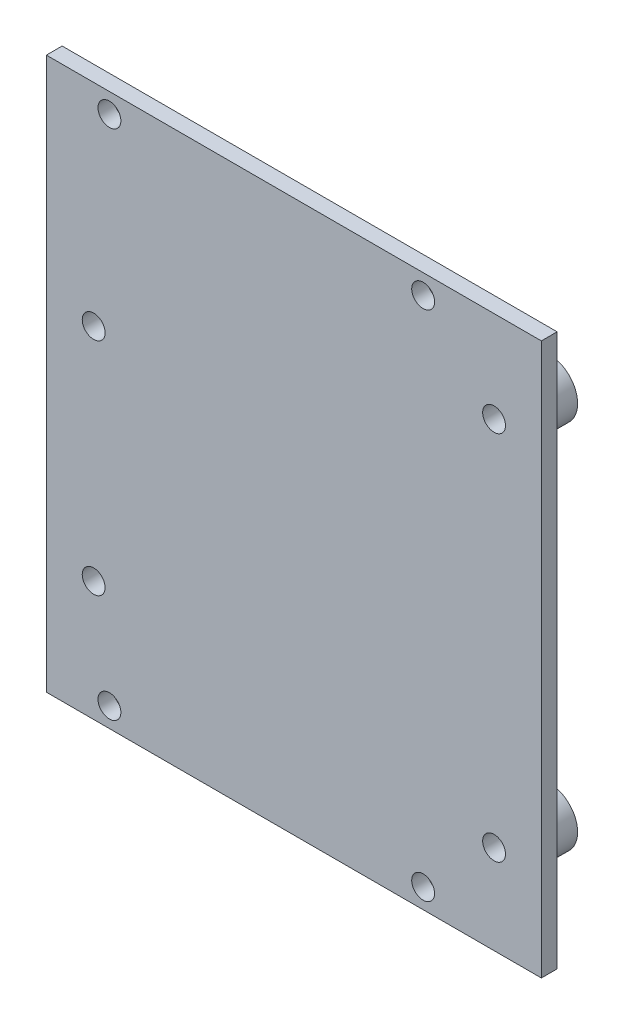
ISO-10303-21;
HEADER;
FILE_DESCRIPTION(('STEP AP214'),'2;1');
FILE_NAME('part.step','',(''),(''),'','','');
FILE_SCHEMA(('AUTOMOTIVE_DESIGN { 1 0 10303 214 1 1 1 1 }'));
ENDSEC;
DATA;
#1=APPLICATION_CONTEXT('core data for automotive mechanical design processes');
#2=APPLICATION_PROTOCOL_DEFINITION('international standard','automotive_design',2000,#1);
#3=PRODUCT_CONTEXT('',#1,'mechanical');
#4=PRODUCT('Part','Part','',(#3));
#5=PRODUCT_RELATED_PRODUCT_CATEGORY('part','',(#4));
#6=PRODUCT_DEFINITION_FORMATION('','',#4);
#7=PRODUCT_DEFINITION_CONTEXT('part definition',#1,'design');
#8=PRODUCT_DEFINITION('design','',#6,#7);
#9=PRODUCT_DEFINITION_SHAPE('','',#8);
#10=(LENGTH_UNIT() NAMED_UNIT(*) SI_UNIT(.MILLI.,.METRE.));
#11=(NAMED_UNIT(*) PLANE_ANGLE_UNIT() SI_UNIT($,.RADIAN.));
#12=(NAMED_UNIT(*) SI_UNIT($,.STERADIAN.) SOLID_ANGLE_UNIT());
#13=UNCERTAINTY_MEASURE_WITH_UNIT(LENGTH_MEASURE(1.E-05),#10,'distance_accuracy_value','');
#14=(GEOMETRIC_REPRESENTATION_CONTEXT(3) GLOBAL_UNCERTAINTY_ASSIGNED_CONTEXT((#13)) GLOBAL_UNIT_ASSIGNED_CONTEXT((#10,
#11,#12)) REPRESENTATION_CONTEXT('',''));
#15=CARTESIAN_POINT('',(0.,0.,0.));
#16=DIRECTION('',(0.,0.,1.));
#17=DIRECTION('',(1.,0.,0.));
#18=AXIS2_PLACEMENT_3D('',#15,#16,#17);
#19=CARTESIAN_POINT('',(-33.,-19.66,5.));
#20=DIRECTION('',(0.,0.,-1.));
#21=DIRECTION('',(-1.,0.,0.));
#22=AXIS2_PLACEMENT_3D('',#19,#20,#21);
#23=CYLINDRICAL_SURFACE('',#22,3.6);
#24=CARTESIAN_POINT('',(-33.,-19.66,5.));
#25=DIRECTION('',(0.,0.,1.));
#26=DIRECTION('',(1.,0.,0.));
#27=AXIS2_PLACEMENT_3D('',#24,#25,#26);
#28=CIRCLE('',#27,3.6);
#29=CARTESIAN_POINT('',(-29.4,-19.66,5.));
#30=VERTEX_POINT('',#29);
#31=EDGE_CURVE('E133',#30,#30,#28,.T.);
#32=ORIENTED_EDGE('',*,*,#31,.F.);
#33=EDGE_LOOP('',(#32));
#34=FACE_BOUND('',#33,.T.);
#35=CARTESIAN_POINT('',(-33.,-19.66,0.));
#36=DIRECTION('',(0.,0.,1.));
#37=DIRECTION('',(1.,0.,0.));
#38=AXIS2_PLACEMENT_3D('',#35,#36,#37);
#39=CIRCLE('',#38,3.6);
#40=CARTESIAN_POINT('',(-29.4,-19.66,0.));
#41=VERTEX_POINT('',#40);
#42=EDGE_CURVE('E132',#41,#41,#39,.T.);
#43=ORIENTED_EDGE('',*,*,#42,.T.);
#44=EDGE_LOOP('',(#43));
#45=FACE_BOUND('',#44,.T.);
#46=ADVANCED_FACE('F41',(#34,#45),#23,.T.);
#47=CARTESIAN_POINT('',(0.,0.,0.));
#48=DIRECTION('',(0.,0.,1.));
#49=DIRECTION('',(1.,0.,0.));
#50=AXIS2_PLACEMENT_3D('',#47,#48,#49);
#51=PLANE('',#50);
#52=CARTESIAN_POINT('',(-33.,-19.66,0.));
#53=DIRECTION('',(0.,0.,-1.));
#54=DIRECTION('',(-1.,0.,0.));
#55=AXIS2_PLACEMENT_3D('',#52,#53,#54);
#56=CIRCLE('',#55,1.44999999999999);
#57=CARTESIAN_POINT('',(-34.45,-19.66,0.));
#58=VERTEX_POINT('',#57);
#59=EDGE_CURVE('E176',#58,#58,#56,.T.);
#60=ORIENTED_EDGE('',*,*,#59,.F.);
#61=EDGE_LOOP('',(#60));
#62=FACE_BOUND('',#61,.T.);
#63=ORIENTED_EDGE('',*,*,#42,.F.);
#64=EDGE_LOOP('',(#63));
#65=FACE_BOUND('',#64,.T.);
#66=ADVANCED_FACE('F242',(#62,#65),#51,.F.);
#67=CARTESIAN_POINT('',(23.8,-34.8699999999999,7.));
#68=DIRECTION('',(-1.,0.,0.));
#69=DIRECTION('',(0.,0.,1.));
#70=AXIS2_PLACEMENT_3D('',#67,#68,#69);
#71=PLANE('',#70);
#72=DIRECTION('',(0.,1.,0.));
#73=VECTOR('',#72,1.);
#74=CARTESIAN_POINT('',(23.8,-34.8699999999999,5.));
#75=LINE('',#74,#73);
#76=CARTESIAN_POINT('',(23.8,-34.8699999999999,5.));
#77=VERTEX_POINT('',#76);
#78=CARTESIAN_POINT('',(23.8,35.1299999999999,5.));
#79=VERTEX_POINT('',#78);
#80=EDGE_CURVE('E115',#77,#79,#75,.T.);
#81=ORIENTED_EDGE('',*,*,#80,.T.);
#82=DIRECTION('',(0.,0.,-1.));
#83=VECTOR('',#82,1.);
#84=CARTESIAN_POINT('',(23.8,35.1299999999999,7.));
#85=LINE('',#84,#83);
#86=CARTESIAN_POINT('',(23.8,35.1299999999999,7.));
#87=VERTEX_POINT('',#86);
#88=EDGE_CURVE('E104',#87,#79,#85,.T.);
#89=ORIENTED_EDGE('',*,*,#88,.F.);
#90=DIRECTION('',(0.,1.,0.));
#91=VECTOR('',#90,1.);
#92=CARTESIAN_POINT('',(23.8,-34.8699999999999,7.));
#93=LINE('',#92,#91);
#94=CARTESIAN_POINT('',(23.8,-34.8699999999999,7.));
#95=VERTEX_POINT('',#94);
#96=EDGE_CURVE('E96',#95,#87,#93,.T.);
#97=ORIENTED_EDGE('',*,*,#96,.F.);
#98=DIRECTION('',(0.,0.,-1.));
#99=VECTOR('',#98,1.);
#100=CARTESIAN_POINT('',(23.8,-34.8699999999999,7.));
#101=LINE('',#100,#99);
#102=EDGE_CURVE('E111',#95,#77,#101,.T.);
#103=ORIENTED_EDGE('',*,*,#102,.T.);
#104=EDGE_LOOP('',(#81,#89,#97,#103));
#105=FACE_BOUND('',#104,.T.);
#106=ADVANCED_FACE('F247',(#105),#71,.F.);
#107=CARTESIAN_POINT('',(23.8,35.1299999999999,7.));
#108=DIRECTION('',(0.,-1.,0.));
#109=DIRECTION('',(1.,0.,0.));
#110=AXIS2_PLACEMENT_3D('',#107,#108,#109);
#111=PLANE('',#110);
#112=DIRECTION('',(-1.,0.,0.));
#113=VECTOR('',#112,1.);
#114=CARTESIAN_POINT('',(23.8,35.1299999999999,5.));
#115=LINE('',#114,#113);
#116=CARTESIAN_POINT('',(-39.,35.1299999999999,5.));
#117=VERTEX_POINT('',#116);
#118=EDGE_CURVE('E102',#79,#117,#115,.T.);
#119=ORIENTED_EDGE('',*,*,#118,.T.);
#120=DIRECTION('',(0.,0.,-1.));
#121=VECTOR('',#120,1.);
#122=CARTESIAN_POINT('',(-39.,35.1299999999999,7.));
#123=LINE('',#122,#121);
#124=CARTESIAN_POINT('',(-39.,35.1299999999999,7.));
#125=VERTEX_POINT('',#124);
#126=EDGE_CURVE('E100',#125,#117,#123,.T.);
#127=ORIENTED_EDGE('',*,*,#126,.F.);
#128=DIRECTION('',(-1.,0.,0.));
#129=VECTOR('',#128,1.);
#130=CARTESIAN_POINT('',(23.8,35.1299999999999,7.));
#131=LINE('',#130,#129);
#132=EDGE_CURVE('E91',#87,#125,#131,.T.);
#133=ORIENTED_EDGE('',*,*,#132,.F.);
#134=ORIENTED_EDGE('',*,*,#88,.T.);
#135=EDGE_LOOP('',(#119,#127,#133,#134));
#136=FACE_BOUND('',#135,.T.);
#137=ADVANCED_FACE('F101',(#136),#111,.F.);
#138=CARTESIAN_POINT('',(-39.,-34.8699999999999,7.));
#139=DIRECTION('',(1.,0.,0.));
#140=DIRECTION('',(0.,0.,-1.));
#141=AXIS2_PLACEMENT_3D('',#138,#139,#140);
#142=PLANE('',#141);
#143=DIRECTION('',(0.,-1.,0.));
#144=VECTOR('',#143,1.);
#145=CARTESIAN_POINT('',(-39.,-34.8699999999999,5.));
#146=LINE('',#145,#144);
#147=CARTESIAN_POINT('',(-39.,-34.8699999999999,5.));
#148=VERTEX_POINT('',#147);
#149=EDGE_CURVE('E77',#117,#148,#146,.T.);
#150=ORIENTED_EDGE('',*,*,#149,.T.);
#151=DIRECTION('',(0.,0.,-1.));
#152=VECTOR('',#151,1.);
#153=CARTESIAN_POINT('',(-39.,-34.8699999999999,7.));
#154=LINE('',#153,#152);
#155=CARTESIAN_POINT('',(-39.,-34.8699999999999,7.));
#156=VERTEX_POINT('',#155);
#157=EDGE_CURVE('E105',#156,#148,#154,.T.);
#158=ORIENTED_EDGE('',*,*,#157,.F.);
#159=DIRECTION('',(0.,-1.,0.));
#160=VECTOR('',#159,1.);
#161=CARTESIAN_POINT('',(-39.,-34.8699999999999,7.));
#162=LINE('',#161,#160);
#163=EDGE_CURVE('E94',#125,#156,#162,.T.);
#164=ORIENTED_EDGE('',*,*,#163,.F.);
#165=ORIENTED_EDGE('',*,*,#126,.T.);
#166=EDGE_LOOP('',(#150,#158,#164,#165));
#167=FACE_BOUND('',#166,.T.);
#168=ADVANCED_FACE('F107',(#167),#142,.F.);
#169=CARTESIAN_POINT('',(23.8,-34.8699999999999,7.));
#170=DIRECTION('',(0.,1.,0.));
#171=DIRECTION('',(-1.,0.,0.));
#172=AXIS2_PLACEMENT_3D('',#169,#170,#171);
#173=PLANE('',#172);
#174=DIRECTION('',(1.,0.,0.));
#175=VECTOR('',#174,1.);
#176=CARTESIAN_POINT('',(23.8,-34.8699999999999,5.));
#177=LINE('',#176,#175);
#178=EDGE_CURVE('E83',#148,#77,#177,.T.);
#179=ORIENTED_EDGE('',*,*,#178,.T.);
#180=ORIENTED_EDGE('',*,*,#102,.F.);
#181=DIRECTION('',(1.,0.,0.));
#182=VECTOR('',#181,1.);
#183=CARTESIAN_POINT('',(23.8,-34.8699999999999,7.));
#184=LINE('',#183,#182);
#185=EDGE_CURVE('E60',#156,#95,#184,.T.);
#186=ORIENTED_EDGE('',*,*,#185,.F.);
#187=ORIENTED_EDGE('',*,*,#157,.T.);
#188=EDGE_LOOP('',(#179,#180,#186,#187));
#189=FACE_BOUND('',#188,.T.);
#190=ADVANCED_FACE('F260',(#189),#173,.F.);
#191=CARTESIAN_POINT('',(0.,0.,7.));
#192=DIRECTION('',(0.,0.,1.));
#193=DIRECTION('',(1.,0.,0.));
#194=AXIS2_PLACEMENT_3D('',#191,#192,#193);
#195=PLANE('',#194);
#196=CARTESIAN_POINT('',(17.8,23.54,7.));
#197=DIRECTION('',(0.,0.,1.));
#198=DIRECTION('',(1.,0.,0.));
#199=AXIS2_PLACEMENT_3D('',#196,#197,#198);
#200=CIRCLE('',#199,1.44999999999999);
#201=CARTESIAN_POINT('',(19.25,23.54,7.));
#202=VERTEX_POINT('',#201);
#203=EDGE_CURVE('E44',#202,#202,#200,.T.);
#204=ORIENTED_EDGE('',*,*,#203,.F.);
#205=EDGE_LOOP('',(#204));
#206=FACE_BOUND('',#205,.T.);
#207=CARTESIAN_POINT('',(-33.,8.33999999999996,7.));
#208=DIRECTION('',(0.,0.,1.));
#209=DIRECTION('',(1.,0.,0.));
#210=AXIS2_PLACEMENT_3D('',#207,#208,#209);
#211=CIRCLE('',#210,1.45);
#212=CARTESIAN_POINT('',(-31.55,8.33999999999996,7.));
#213=VERTEX_POINT('',#212);
#214=EDGE_CURVE('E177',#213,#213,#211,.T.);
#215=ORIENTED_EDGE('',*,*,#214,.F.);
#216=EDGE_LOOP('',(#215));
#217=FACE_BOUND('',#216,.T.);
#218=CARTESIAN_POINT('',(-33.,-19.66,7.));
#219=DIRECTION('',(0.,0.,1.));
#220=DIRECTION('',(1.,0.,0.));
#221=AXIS2_PLACEMENT_3D('',#218,#219,#220);
#222=CIRCLE('',#221,1.44999999999999);
#223=CARTESIAN_POINT('',(-31.55,-19.66,7.));
#224=VERTEX_POINT('',#223);
#225=EDGE_CURVE('E173',#224,#224,#222,.T.);
#226=ORIENTED_EDGE('',*,*,#225,.F.);
#227=EDGE_LOOP('',(#226));
#228=FACE_BOUND('',#227,.T.);
#229=CARTESIAN_POINT('',(17.8,-23.54,7.));
#230=DIRECTION('',(0.,0.,1.));
#231=DIRECTION('',(1.,0.,0.));
#232=AXIS2_PLACEMENT_3D('',#229,#230,#231);
#233=CIRCLE('',#232,1.44999999999999);
#234=CARTESIAN_POINT('',(19.25,-23.54,7.));
#235=VERTEX_POINT('',#234);
#236=EDGE_CURVE('E168',#235,#235,#233,.T.);
#237=ORIENTED_EDGE('',*,*,#236,.F.);
#238=EDGE_LOOP('',(#237));
#239=FACE_BOUND('',#238,.T.);
#240=CARTESIAN_POINT('',(8.80000000000004,-32.37,7.));
#241=DIRECTION('',(0.,0.,1.));
#242=DIRECTION('',(1.,0.,0.));
#243=AXIS2_PLACEMENT_3D('',#240,#241,#242);
#244=CIRCLE('',#243,1.44999999999999);
#245=CARTESIAN_POINT('',(10.25,-32.37,7.));
#246=VERTEX_POINT('',#245);
#247=EDGE_CURVE('E167',#246,#246,#244,.T.);
#248=ORIENTED_EDGE('',*,*,#247,.F.);
#249=EDGE_LOOP('',(#248));
#250=FACE_BOUND('',#249,.T.);
#251=CARTESIAN_POINT('',(-30.9999999999999,-32.3700000000001,7.));
#252=DIRECTION('',(0.,0.,1.));
#253=DIRECTION('',(1.,0.,0.));
#254=AXIS2_PLACEMENT_3D('',#251,#252,#253);
#255=CIRCLE('',#254,1.44999999999999);
#256=CARTESIAN_POINT('',(-29.5499999999999,-32.3700000000001,7.));
#257=VERTEX_POINT('',#256);
#258=EDGE_CURVE('E162',#257,#257,#255,.T.);
#259=ORIENTED_EDGE('',*,*,#258,.F.);
#260=EDGE_LOOP('',(#259));
#261=FACE_BOUND('',#260,.T.);
#262=CARTESIAN_POINT('',(-31.,32.63,7.));
#263=DIRECTION('',(0.,0.,1.));
#264=DIRECTION('',(1.,0.,0.));
#265=AXIS2_PLACEMENT_3D('',#262,#263,#264);
#266=CIRCLE('',#265,1.44999999999999);
#267=CARTESIAN_POINT('',(-29.55,32.63,7.));
#268=VERTEX_POINT('',#267);
#269=EDGE_CURVE('E157',#268,#268,#266,.T.);
#270=ORIENTED_EDGE('',*,*,#269,.F.);
#271=EDGE_LOOP('',(#270));
#272=FACE_BOUND('',#271,.T.);
#273=CARTESIAN_POINT('',(8.79999999999995,32.63,7.));
#274=DIRECTION('',(0.,0.,1.));
#275=DIRECTION('',(1.,0.,0.));
#276=AXIS2_PLACEMENT_3D('',#273,#274,#275);
#277=CIRCLE('',#276,1.44999999999999);
#278=CARTESIAN_POINT('',(10.2499999999999,32.63,7.));
#279=VERTEX_POINT('',#278);
#280=EDGE_CURVE('E152',#279,#279,#277,.T.);
#281=ORIENTED_EDGE('',*,*,#280,.F.);
#282=EDGE_LOOP('',(#281));
#283=FACE_BOUND('',#282,.T.);
#284=ORIENTED_EDGE('',*,*,#96,.T.);
#285=ORIENTED_EDGE('',*,*,#132,.T.);
#286=ORIENTED_EDGE('',*,*,#163,.T.);
#287=ORIENTED_EDGE('',*,*,#185,.T.);
#288=EDGE_LOOP('',(#284,#285,#286,#287));
#289=FACE_BOUND('',#288,.T.);
#290=ADVANCED_FACE('F92',(#206,#217,#228,#239,#250,#261,#272,#283,#289),#195,.T.);
#291=CARTESIAN_POINT('',(0.,0.,5.));
#292=DIRECTION('',(0.,0.,1.));
#293=DIRECTION('',(1.,0.,0.));
#294=AXIS2_PLACEMENT_3D('',#291,#292,#293);
#295=PLANE('',#294);
#296=CARTESIAN_POINT('',(8.80000000000004,-32.37,5.));
#297=DIRECTION('',(0.,0.,1.));
#298=DIRECTION('',(1.,0.,0.));
#299=AXIS2_PLACEMENT_3D('',#296,#297,#298);
#300=CIRCLE('',#299,1.44999999999999);
#301=CARTESIAN_POINT('',(10.25,-32.37,5.));
#302=VERTEX_POINT('',#301);
#303=EDGE_CURVE('E163',#302,#302,#300,.T.);
#304=ORIENTED_EDGE('',*,*,#303,.T.);
#305=EDGE_LOOP('',(#304));
#306=FACE_BOUND('',#305,.T.);
#307=CARTESIAN_POINT('',(-30.9999999999999,-32.3700000000001,5.));
#308=DIRECTION('',(0.,0.,1.));
#309=DIRECTION('',(1.,0.,0.));
#310=AXIS2_PLACEMENT_3D('',#307,#308,#309);
#311=CIRCLE('',#310,1.44999999999999);
#312=CARTESIAN_POINT('',(-29.5499999999999,-32.3700000000001,5.));
#313=VERTEX_POINT('',#312);
#314=EDGE_CURVE('E158',#313,#313,#311,.T.);
#315=ORIENTED_EDGE('',*,*,#314,.T.);
#316=EDGE_LOOP('',(#315));
#317=FACE_BOUND('',#316,.T.);
#318=CARTESIAN_POINT('',(-31.,32.63,5.));
#319=DIRECTION('',(0.,0.,1.));
#320=DIRECTION('',(1.,0.,0.));
#321=AXIS2_PLACEMENT_3D('',#318,#319,#320);
#322=CIRCLE('',#321,1.44999999999999);
#323=CARTESIAN_POINT('',(-29.55,32.63,5.));
#324=VERTEX_POINT('',#323);
#325=EDGE_CURVE('E153',#324,#324,#322,.T.);
#326=ORIENTED_EDGE('',*,*,#325,.T.);
#327=EDGE_LOOP('',(#326));
#328=FACE_BOUND('',#327,.T.);
#329=CARTESIAN_POINT('',(8.79999999999995,32.63,5.));
#330=DIRECTION('',(0.,0.,1.));
#331=DIRECTION('',(1.,0.,0.));
#332=AXIS2_PLACEMENT_3D('',#329,#330,#331);
#333=CIRCLE('',#332,1.44999999999999);
#334=CARTESIAN_POINT('',(10.2499999999999,32.63,5.));
#335=VERTEX_POINT('',#334);
#336=EDGE_CURVE('E147',#335,#335,#333,.T.);
#337=ORIENTED_EDGE('',*,*,#336,.T.);
#338=EDGE_LOOP('',(#337));
#339=FACE_BOUND('',#338,.T.);
#340=CARTESIAN_POINT('',(17.8,23.54,5.));
#341=DIRECTION('',(0.,0.,1.));
#342=DIRECTION('',(1.,0.,0.));
#343=AXIS2_PLACEMENT_3D('',#340,#341,#342);
#344=CIRCLE('',#343,3.6);
#345=CARTESIAN_POINT('',(21.4,23.54,5.));
#346=VERTEX_POINT('',#345);
#347=EDGE_CURVE('E11',#346,#346,#344,.F.);
#348=ORIENTED_EDGE('',*,*,#347,.F.);
#349=EDGE_LOOP('',(#348));
#350=FACE_BOUND('',#349,.T.);
#351=CARTESIAN_POINT('',(17.8,-23.54,5.));
#352=DIRECTION('',(0.,0.,1.));
#353=DIRECTION('',(1.,0.,0.));
#354=AXIS2_PLACEMENT_3D('',#351,#352,#353);
#355=CIRCLE('',#354,3.6);
#356=CARTESIAN_POINT('',(21.4,-23.54,5.));
#357=VERTEX_POINT('',#356);
#358=EDGE_CURVE('E51',#357,#357,#355,.F.);
#359=ORIENTED_EDGE('',*,*,#358,.F.);
#360=EDGE_LOOP('',(#359));
#361=FACE_BOUND('',#360,.T.);
#362=CARTESIAN_POINT('',(-33.,8.33999999999996,5.));
#363=DIRECTION('',(0.,0.,1.));
#364=DIRECTION('',(1.,0.,0.));
#365=AXIS2_PLACEMENT_3D('',#362,#363,#364);
#366=CIRCLE('',#365,3.6);
#367=CARTESIAN_POINT('',(-29.4,8.33999999999996,5.));
#368=VERTEX_POINT('',#367);
#369=EDGE_CURVE('E137',#368,#368,#366,.F.);
#370=ORIENTED_EDGE('',*,*,#369,.F.);
#371=EDGE_LOOP('',(#370));
#372=FACE_BOUND('',#371,.T.);
#373=ORIENTED_EDGE('',*,*,#31,.T.);
#374=EDGE_LOOP('',(#373));
#375=FACE_BOUND('',#374,.T.);
#376=ORIENTED_EDGE('',*,*,#80,.F.);
#377=ORIENTED_EDGE('',*,*,#178,.F.);
#378=ORIENTED_EDGE('',*,*,#149,.F.);
#379=ORIENTED_EDGE('',*,*,#118,.F.);
#380=EDGE_LOOP('',(#376,#377,#378,#379));
#381=FACE_BOUND('',#380,.T.);
#382=ADVANCED_FACE('F237',(#306,#317,#328,#339,#350,#361,#372,#375,#381),#295,.F.);
#383=CARTESIAN_POINT('',(-33.,8.33999999999996,5.));
#384=DIRECTION('',(0.,0.,-1.));
#385=DIRECTION('',(-1.,0.,0.));
#386=AXIS2_PLACEMENT_3D('',#383,#384,#385);
#387=CYLINDRICAL_SURFACE('',#386,3.6);
#388=ORIENTED_EDGE('',*,*,#369,.T.);
#389=EDGE_LOOP('',(#388));
#390=FACE_BOUND('',#389,.T.);
#391=CARTESIAN_POINT('',(-33.,8.33999999999996,0.));
#392=DIRECTION('',(0.,0.,1.));
#393=DIRECTION('',(1.,0.,0.));
#394=AXIS2_PLACEMENT_3D('',#391,#392,#393);
#395=CIRCLE('',#394,3.6);
#396=CARTESIAN_POINT('',(-29.4,8.33999999999996,0.));
#397=VERTEX_POINT('',#396);
#398=EDGE_CURVE('E119',#397,#397,#395,.T.);
#399=ORIENTED_EDGE('',*,*,#398,.T.);
#400=EDGE_LOOP('',(#399));
#401=FACE_BOUND('',#400,.T.);
#402=ADVANCED_FACE('F223',(#390,#401),#387,.T.);
#403=CARTESIAN_POINT('',(-33.,8.33999999999996,0.));
#404=DIRECTION('',(0.,0.,1.));
#405=DIRECTION('',(1.,0.,0.));
#406=AXIS2_PLACEMENT_3D('',#403,#404,#405);
#407=PLANE('',#406);
#408=CARTESIAN_POINT('',(-33.,8.33999999999996,0.));
#409=DIRECTION('',(0.,0.,-1.));
#410=DIRECTION('',(-1.,0.,0.));
#411=AXIS2_PLACEMENT_3D('',#408,#409,#410);
#412=CIRCLE('',#411,1.44999999999999);
#413=CARTESIAN_POINT('',(-34.45,8.33999999999996,0.));
#414=VERTEX_POINT('',#413);
#415=EDGE_CURVE('E180',#414,#414,#412,.T.);
#416=ORIENTED_EDGE('',*,*,#415,.F.);
#417=EDGE_LOOP('',(#416));
#418=FACE_BOUND('',#417,.T.);
#419=ORIENTED_EDGE('',*,*,#398,.F.);
#420=EDGE_LOOP('',(#419));
#421=FACE_BOUND('',#420,.T.);
#422=ADVANCED_FACE('F225',(#418,#421),#407,.F.);
#423=CARTESIAN_POINT('',(17.8,-23.54,5.));
#424=DIRECTION('',(0.,0.,-1.));
#425=DIRECTION('',(-1.,0.,0.));
#426=AXIS2_PLACEMENT_3D('',#423,#424,#425);
#427=CYLINDRICAL_SURFACE('',#426,3.6);
#428=ORIENTED_EDGE('',*,*,#358,.T.);
#429=EDGE_LOOP('',(#428));
#430=FACE_BOUND('',#429,.T.);
#431=CARTESIAN_POINT('',(17.8,-23.54,0.));
#432=DIRECTION('',(0.,0.,1.));
#433=DIRECTION('',(1.,0.,0.));
#434=AXIS2_PLACEMENT_3D('',#431,#432,#433);
#435=CIRCLE('',#434,3.6);
#436=CARTESIAN_POINT('',(21.4,-23.54,0.));
#437=VERTEX_POINT('',#436);
#438=EDGE_CURVE('E214',#437,#437,#435,.T.);
#439=ORIENTED_EDGE('',*,*,#438,.T.);
#440=EDGE_LOOP('',(#439));
#441=FACE_BOUND('',#440,.T.);
#442=ADVANCED_FACE('F227',(#430,#441),#427,.T.);
#443=CARTESIAN_POINT('',(17.8,-23.54,0.));
#444=DIRECTION('',(0.,0.,1.));
#445=DIRECTION('',(1.,0.,0.));
#446=AXIS2_PLACEMENT_3D('',#443,#444,#445);
#447=PLANE('',#446);
#448=CARTESIAN_POINT('',(17.8,-23.54,0.));
#449=DIRECTION('',(0.,0.,-1.));
#450=DIRECTION('',(-1.,0.,0.));
#451=AXIS2_PLACEMENT_3D('',#448,#449,#450);
#452=CIRCLE('',#451,1.44999999999999);
#453=CARTESIAN_POINT('',(16.35,-23.54,0.));
#454=VERTEX_POINT('',#453);
#455=EDGE_CURVE('E172',#454,#454,#452,.T.);
#456=ORIENTED_EDGE('',*,*,#455,.F.);
#457=EDGE_LOOP('',(#456));
#458=FACE_BOUND('',#457,.T.);
#459=ORIENTED_EDGE('',*,*,#438,.F.);
#460=EDGE_LOOP('',(#459));
#461=FACE_BOUND('',#460,.T.);
#462=ADVANCED_FACE('F234',(#458,#461),#447,.F.);
#463=CARTESIAN_POINT('',(17.8,23.54,5.));
#464=DIRECTION('',(0.,0.,-1.));
#465=DIRECTION('',(-1.,0.,0.));
#466=AXIS2_PLACEMENT_3D('',#463,#464,#465);
#467=CYLINDRICAL_SURFACE('',#466,3.6);
#468=ORIENTED_EDGE('',*,*,#347,.T.);
#469=EDGE_LOOP('',(#468));
#470=FACE_BOUND('',#469,.T.);
#471=CARTESIAN_POINT('',(17.8,23.54,0.));
#472=DIRECTION('',(0.,0.,1.));
#473=DIRECTION('',(1.,0.,0.));
#474=AXIS2_PLACEMENT_3D('',#471,#472,#473);
#475=CIRCLE('',#474,3.6);
#476=CARTESIAN_POINT('',(21.4,23.54,0.));
#477=VERTEX_POINT('',#476);
#478=EDGE_CURVE('E151',#477,#477,#475,.T.);
#479=ORIENTED_EDGE('',*,*,#478,.T.);
#480=EDGE_LOOP('',(#479));
#481=FACE_BOUND('',#480,.T.);
#482=ADVANCED_FACE('F311',(#470,#481),#467,.T.);
#483=CARTESIAN_POINT('',(17.8,23.54,0.));
#484=DIRECTION('',(0.,0.,1.));
#485=DIRECTION('',(1.,0.,0.));
#486=AXIS2_PLACEMENT_3D('',#483,#484,#485);
#487=PLANE('',#486);
#488=CARTESIAN_POINT('',(17.8,23.54,0.));
#489=DIRECTION('',(0.,0.,-1.));
#490=DIRECTION('',(-1.,0.,0.));
#491=AXIS2_PLACEMENT_3D('',#488,#489,#490);
#492=CIRCLE('',#491,1.44999999999999);
#493=CARTESIAN_POINT('',(16.35,23.54,0.));
#494=VERTEX_POINT('',#493);
#495=EDGE_CURVE('E193',#494,#494,#492,.T.);
#496=ORIENTED_EDGE('',*,*,#495,.F.);
#497=EDGE_LOOP('',(#496));
#498=FACE_BOUND('',#497,.T.);
#499=ORIENTED_EDGE('',*,*,#478,.F.);
#500=EDGE_LOOP('',(#499));
#501=FACE_BOUND('',#500,.T.);
#502=ADVANCED_FACE('F316',(#498,#501),#487,.F.);
#503=CARTESIAN_POINT('',(8.79999999999995,32.63,7.));
#504=DIRECTION('',(0.,0.,1.));
#505=DIRECTION('',(1.,0.,0.));
#506=AXIS2_PLACEMENT_3D('',#503,#504,#505);
#507=CYLINDRICAL_SURFACE('',#506,1.44999999999999);
#508=ORIENTED_EDGE('',*,*,#280,.T.);
#509=EDGE_LOOP('',(#508));
#510=FACE_BOUND('',#509,.T.);
#511=ORIENTED_EDGE('',*,*,#336,.F.);
#512=EDGE_LOOP('',(#511));
#513=FACE_BOUND('',#512,.T.);
#514=ADVANCED_FACE('F331',(#510,#513),#507,.F.);
#515=CARTESIAN_POINT('',(-31.,32.63,7.));
#516=DIRECTION('',(0.,0.,1.));
#517=DIRECTION('',(1.,0.,0.));
#518=AXIS2_PLACEMENT_3D('',#515,#516,#517);
#519=CYLINDRICAL_SURFACE('',#518,1.44999999999999);
#520=ORIENTED_EDGE('',*,*,#269,.T.);
#521=EDGE_LOOP('',(#520));
#522=FACE_BOUND('',#521,.T.);
#523=ORIENTED_EDGE('',*,*,#325,.F.);
#524=EDGE_LOOP('',(#523));
#525=FACE_BOUND('',#524,.T.);
#526=ADVANCED_FACE('F335',(#522,#525),#519,.F.);
#527=CARTESIAN_POINT('',(-30.9999999999999,-32.3700000000001,7.));
#528=DIRECTION('',(0.,0.,1.));
#529=DIRECTION('',(1.,0.,0.));
#530=AXIS2_PLACEMENT_3D('',#527,#528,#529);
#531=CYLINDRICAL_SURFACE('',#530,1.44999999999999);
#532=ORIENTED_EDGE('',*,*,#258,.T.);
#533=EDGE_LOOP('',(#532));
#534=FACE_BOUND('',#533,.T.);
#535=ORIENTED_EDGE('',*,*,#314,.F.);
#536=EDGE_LOOP('',(#535));
#537=FACE_BOUND('',#536,.T.);
#538=ADVANCED_FACE('F345',(#534,#537),#531,.F.);
#539=CARTESIAN_POINT('',(8.80000000000004,-32.37,7.));
#540=DIRECTION('',(0.,0.,1.));
#541=DIRECTION('',(1.,0.,0.));
#542=AXIS2_PLACEMENT_3D('',#539,#540,#541);
#543=CYLINDRICAL_SURFACE('',#542,1.44999999999999);
#544=ORIENTED_EDGE('',*,*,#247,.T.);
#545=EDGE_LOOP('',(#544));
#546=FACE_BOUND('',#545,.T.);
#547=ORIENTED_EDGE('',*,*,#303,.F.);
#548=EDGE_LOOP('',(#547));
#549=FACE_BOUND('',#548,.T.);
#550=ADVANCED_FACE('F355',(#546,#549),#543,.F.);
#551=CARTESIAN_POINT('',(17.8,-23.54,0.));
#552=DIRECTION('',(0.,0.,-1.));
#553=DIRECTION('',(-1.,0.,0.));
#554=AXIS2_PLACEMENT_3D('',#551,#552,#553);
#555=CYLINDRICAL_SURFACE('',#554,1.44999999999999);
#556=ORIENTED_EDGE('',*,*,#236,.T.);
#557=EDGE_LOOP('',(#556));
#558=FACE_BOUND('',#557,.T.);
#559=ORIENTED_EDGE('',*,*,#455,.T.);
#560=EDGE_LOOP('',(#559));
#561=FACE_BOUND('',#560,.T.);
#562=ADVANCED_FACE('F364',(#558,#561),#555,.F.);
#563=CARTESIAN_POINT('',(-33.,-19.66,0.));
#564=DIRECTION('',(0.,0.,-1.));
#565=DIRECTION('',(-1.,0.,0.));
#566=AXIS2_PLACEMENT_3D('',#563,#564,#565);
#567=CYLINDRICAL_SURFACE('',#566,1.44999999999999);
#568=ORIENTED_EDGE('',*,*,#225,.T.);
#569=EDGE_LOOP('',(#568));
#570=FACE_BOUND('',#569,.T.);
#571=ORIENTED_EDGE('',*,*,#59,.T.);
#572=EDGE_LOOP('',(#571));
#573=FACE_BOUND('',#572,.T.);
#574=ADVANCED_FACE('F401',(#570,#573),#567,.F.);
#575=CARTESIAN_POINT('',(-33.,8.33999999999996,0.));
#576=DIRECTION('',(0.,0.,-1.));
#577=DIRECTION('',(-1.,0.,0.));
#578=AXIS2_PLACEMENT_3D('',#575,#576,#577);
#579=CYLINDRICAL_SURFACE('',#578,1.45);
#580=ORIENTED_EDGE('',*,*,#214,.T.);
#581=EDGE_LOOP('',(#580));
#582=FACE_BOUND('',#581,.T.);
#583=ORIENTED_EDGE('',*,*,#415,.T.);
#584=EDGE_LOOP('',(#583));
#585=FACE_BOUND('',#584,.T.);
#586=ADVANCED_FACE('F411',(#582,#585),#579,.F.);
#587=CARTESIAN_POINT('',(17.8,23.54,0.));
#588=DIRECTION('',(0.,0.,-1.));
#589=DIRECTION('',(-1.,0.,0.));
#590=AXIS2_PLACEMENT_3D('',#587,#588,#589);
#591=CYLINDRICAL_SURFACE('',#590,1.44999999999999);
#592=ORIENTED_EDGE('',*,*,#203,.T.);
#593=EDGE_LOOP('',(#592));
#594=FACE_BOUND('',#593,.T.);
#595=ORIENTED_EDGE('',*,*,#495,.T.);
#596=EDGE_LOOP('',(#595));
#597=FACE_BOUND('',#596,.T.);
#598=ADVANCED_FACE('F421',(#594,#597),#591,.F.);
#599=CLOSED_SHELL('',(#46,#66,#106,#137,#168,#190,#290,#382,#402,#422,#442,#462,#482,#502,#514,
#526,#538,#550,#562,#574,#586,#598));
#600=MANIFOLD_SOLID_BREP('B2',#599);
#601=ADVANCED_BREP_SHAPE_REPRESENTATION('',(#18,#600),#14);
#602=SHAPE_DEFINITION_REPRESENTATION(#9,#601);
ENDSEC;
END-ISO-10303-21;
